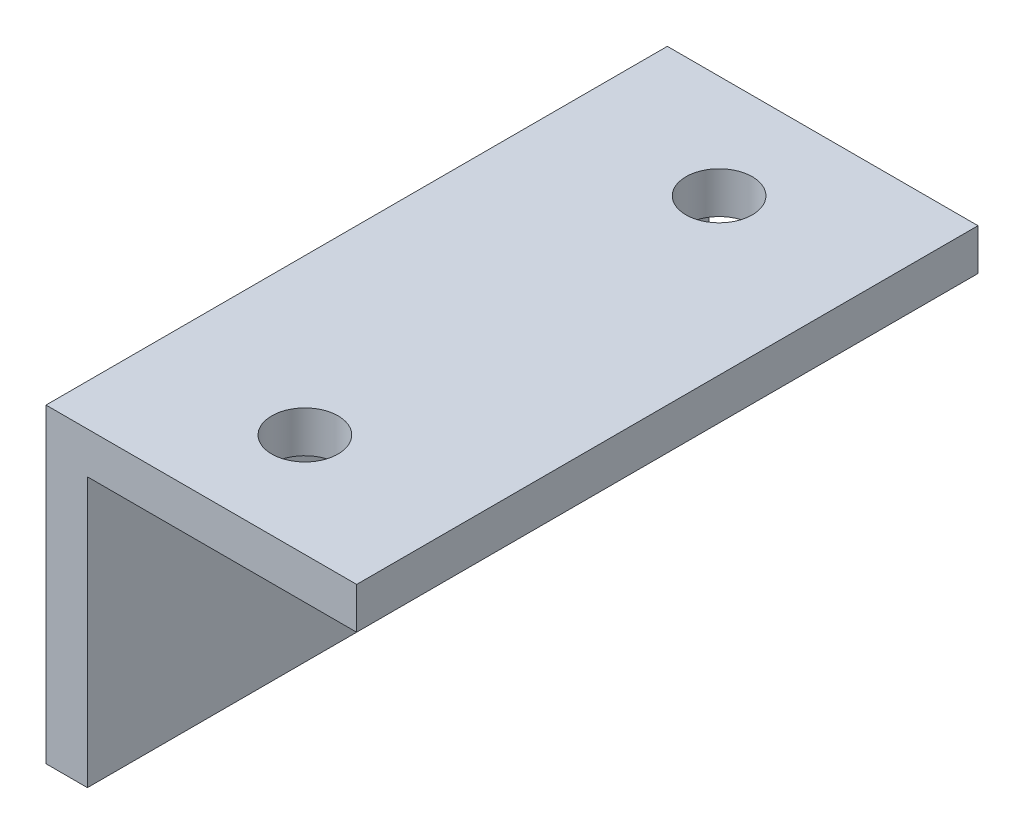
ISO-10303-21;
HEADER;
FILE_DESCRIPTION(('STEP AP214'),'2;1');
FILE_NAME('part.step','',(''),(''),'','','');
FILE_SCHEMA(('AUTOMOTIVE_DESIGN { 1 0 10303 214 1 1 1 1 }'));
ENDSEC;
DATA;
#1=APPLICATION_CONTEXT('core data for automotive mechanical design processes');
#2=APPLICATION_PROTOCOL_DEFINITION('international standard','automotive_design',2000,#1);
#3=PRODUCT_CONTEXT('',#1,'mechanical');
#4=PRODUCT('Part','Part','',(#3));
#5=PRODUCT_RELATED_PRODUCT_CATEGORY('part','',(#4));
#6=PRODUCT_DEFINITION_FORMATION('','',#4);
#7=PRODUCT_DEFINITION_CONTEXT('part definition',#1,'design');
#8=PRODUCT_DEFINITION('design','',#6,#7);
#9=PRODUCT_DEFINITION_SHAPE('','',#8);
#10=(LENGTH_UNIT() NAMED_UNIT(*) SI_UNIT(.MILLI.,.METRE.));
#11=(NAMED_UNIT(*) PLANE_ANGLE_UNIT() SI_UNIT($,.RADIAN.));
#12=(NAMED_UNIT(*) SI_UNIT($,.STERADIAN.) SOLID_ANGLE_UNIT());
#13=UNCERTAINTY_MEASURE_WITH_UNIT(LENGTH_MEASURE(1.E-05),#10,'distance_accuracy_value','');
#14=(GEOMETRIC_REPRESENTATION_CONTEXT(3) GLOBAL_UNCERTAINTY_ASSIGNED_CONTEXT((#13)) GLOBAL_UNIT_ASSIGNED_CONTEXT((#10,
#11,#12)) REPRESENTATION_CONTEXT('',''));
#15=CARTESIAN_POINT('',(0.,0.,0.));
#16=DIRECTION('',(0.,0.,1.));
#17=DIRECTION('',(1.,0.,0.));
#18=AXIS2_PLACEMENT_3D('',#15,#16,#17);
#19=CARTESIAN_POINT('',(15.,0.,30.));
#20=DIRECTION('',(0.,-1.,0.));
#21=DIRECTION('',(1.,0.,0.));
#22=AXIS2_PLACEMENT_3D('',#19,#20,#21);
#23=PLANE('',#22);
#24=CARTESIAN_POINT('',(7.5,0.,5.));
#25=DIRECTION('',(0.,1.,0.));
#26=DIRECTION('',(-1.,0.,0.));
#27=AXIS2_PLACEMENT_3D('',#24,#25,#26);
#28=CIRCLE('',#27,1.6);
#29=CARTESIAN_POINT('',(5.9,0.,5.));
#30=VERTEX_POINT('',#29);
#31=EDGE_CURVE('E138',#30,#30,#28,.T.);
#32=ORIENTED_EDGE('',*,*,#31,.F.);
#33=EDGE_LOOP('',(#32));
#34=FACE_BOUND('',#33,.T.);
#35=CARTESIAN_POINT('',(7.5,0.,25.));
#36=DIRECTION('',(0.,1.,0.));
#37=DIRECTION('',(-1.,0.,0.));
#38=AXIS2_PLACEMENT_3D('',#35,#36,#37);
#39=CIRCLE('',#38,1.6);
#40=CARTESIAN_POINT('',(5.9,0.,25.));
#41=VERTEX_POINT('',#40);
#42=EDGE_CURVE('E173',#41,#41,#39,.T.);
#43=ORIENTED_EDGE('',*,*,#42,.F.);
#44=EDGE_LOOP('',(#43));
#45=FACE_BOUND('',#44,.T.);
#46=DIRECTION('',(-1.,0.,0.));
#47=VECTOR('',#46,1.);
#48=CARTESIAN_POINT('',(15.,0.,0.));
#49=LINE('',#48,#47);
#50=CARTESIAN_POINT('',(15.,0.,0.));
#51=VERTEX_POINT('',#50);
#52=CARTESIAN_POINT('',(0.,0.,0.));
#53=VERTEX_POINT('',#52);
#54=EDGE_CURVE('E119',#51,#53,#49,.T.);
#55=ORIENTED_EDGE('',*,*,#54,.T.);
#56=DIRECTION('',(0.,0.,-1.));
#57=VECTOR('',#56,1.);
#58=CARTESIAN_POINT('',(0.,0.,30.));
#59=LINE('',#58,#57);
#60=CARTESIAN_POINT('',(0.,0.,30.));
#61=VERTEX_POINT('',#60);
#62=EDGE_CURVE('E11',#61,#53,#59,.T.);
#63=ORIENTED_EDGE('',*,*,#62,.F.);
#64=DIRECTION('',(-1.,0.,0.));
#65=VECTOR('',#64,1.);
#66=CARTESIAN_POINT('',(15.,0.,30.));
#67=LINE('',#66,#65);
#68=CARTESIAN_POINT('',(15.,0.,30.));
#69=VERTEX_POINT('',#68);
#70=EDGE_CURVE('E130',#69,#61,#67,.T.);
#71=ORIENTED_EDGE('',*,*,#70,.F.);
#72=DIRECTION('',(0.,0.,-1.));
#73=VECTOR('',#72,1.);
#74=CARTESIAN_POINT('',(15.,0.,30.));
#75=LINE('',#74,#73);
#76=EDGE_CURVE('E115',#69,#51,#75,.T.);
#77=ORIENTED_EDGE('',*,*,#76,.T.);
#78=EDGE_LOOP('',(#55,#63,#71,#77));
#79=FACE_BOUND('',#78,.T.);
#80=ADVANCED_FACE('F33',(#34,#45,#79),#23,.F.);
#81=CARTESIAN_POINT('',(0.,0.,30.));
#82=DIRECTION('',(1.,0.,0.));
#83=DIRECTION('',(0.,1.,0.));
#84=AXIS2_PLACEMENT_3D('',#81,#82,#83);
#85=PLANE('',#84);
#86=CARTESIAN_POINT('',(0.,-9.,15.));
#87=DIRECTION('',(-1.,0.,0.));
#88=DIRECTION('',(0.,-1.,0.));
#89=AXIS2_PLACEMENT_3D('',#86,#87,#88);
#90=CIRCLE('',#89,2.1);
#91=CARTESIAN_POINT('',(0.,-11.1,15.));
#92=VERTEX_POINT('',#91);
#93=EDGE_CURVE('E185',#92,#92,#90,.T.);
#94=ORIENTED_EDGE('',*,*,#93,.F.);
#95=EDGE_LOOP('',(#94));
#96=FACE_BOUND('',#95,.T.);
#97=DIRECTION('',(0.,-1.,0.));
#98=VECTOR('',#97,1.);
#99=CARTESIAN_POINT('',(0.,0.,0.));
#100=LINE('',#99,#98);
#101=CARTESIAN_POINT('',(0.,-15.,0.));
#102=VERTEX_POINT('',#101);
#103=EDGE_CURVE('E122',#53,#102,#100,.T.);
#104=ORIENTED_EDGE('',*,*,#103,.T.);
#105=DIRECTION('',(0.,0.,-1.));
#106=VECTOR('',#105,1.);
#107=CARTESIAN_POINT('',(0.,-15.,30.));
#108=LINE('',#107,#106);
#109=CARTESIAN_POINT('',(0.,-15.,30.));
#110=VERTEX_POINT('',#109);
#111=EDGE_CURVE('E42',#110,#102,#108,.T.);
#112=ORIENTED_EDGE('',*,*,#111,.F.);
#113=DIRECTION('',(0.,-1.,0.));
#114=VECTOR('',#113,1.);
#115=CARTESIAN_POINT('',(0.,0.,30.));
#116=LINE('',#115,#114);
#117=EDGE_CURVE('E88',#61,#110,#116,.T.);
#118=ORIENTED_EDGE('',*,*,#117,.F.);
#119=ORIENTED_EDGE('',*,*,#62,.T.);
#120=EDGE_LOOP('',(#104,#112,#118,#119));
#121=FACE_BOUND('',#120,.T.);
#122=ADVANCED_FACE('F161',(#96,#121),#85,.F.);
#123=CARTESIAN_POINT('',(0.,-15.,30.));
#124=DIRECTION('',(0.,1.,0.));
#125=DIRECTION('',(0.,0.,1.));
#126=AXIS2_PLACEMENT_3D('',#123,#124,#125);
#127=PLANE('',#126);
#128=DIRECTION('',(1.,0.,0.));
#129=VECTOR('',#128,1.);
#130=CARTESIAN_POINT('',(0.,-15.,0.));
#131=LINE('',#130,#129);
#132=CARTESIAN_POINT('',(2.,-15.,0.));
#133=VERTEX_POINT('',#132);
#134=EDGE_CURVE('E125',#102,#133,#131,.T.);
#135=ORIENTED_EDGE('',*,*,#134,.T.);
#136=DIRECTION('',(0.,0.,-1.));
#137=VECTOR('',#136,1.);
#138=CARTESIAN_POINT('',(2.,-15.,30.));
#139=LINE('',#138,#137);
#140=CARTESIAN_POINT('',(2.,-15.,30.));
#141=VERTEX_POINT('',#140);
#142=EDGE_CURVE('E110',#141,#133,#139,.T.);
#143=ORIENTED_EDGE('',*,*,#142,.F.);
#144=DIRECTION('',(1.,0.,0.));
#145=VECTOR('',#144,1.);
#146=CARTESIAN_POINT('',(0.,-15.,30.));
#147=LINE('',#146,#145);
#148=EDGE_CURVE('E101',#110,#141,#147,.T.);
#149=ORIENTED_EDGE('',*,*,#148,.F.);
#150=ORIENTED_EDGE('',*,*,#111,.T.);
#151=EDGE_LOOP('',(#135,#143,#149,#150));
#152=FACE_BOUND('',#151,.T.);
#153=ADVANCED_FACE('F166',(#152),#127,.F.);
#154=CARTESIAN_POINT('',(2.,-15.,30.));
#155=DIRECTION('',(-1.,0.,0.));
#156=DIRECTION('',(0.,-1.,0.));
#157=AXIS2_PLACEMENT_3D('',#154,#155,#156);
#158=PLANE('',#157);
#159=CARTESIAN_POINT('',(2.,-9.,15.));
#160=DIRECTION('',(-1.,0.,0.));
#161=DIRECTION('',(0.,-1.,0.));
#162=AXIS2_PLACEMENT_3D('',#159,#160,#161);
#163=CIRCLE('',#162,2.1);
#164=CARTESIAN_POINT('',(2.,-11.1,15.));
#165=VERTEX_POINT('',#164);
#166=EDGE_CURVE('E36',#165,#165,#163,.T.);
#167=ORIENTED_EDGE('',*,*,#166,.T.);
#168=EDGE_LOOP('',(#167));
#169=FACE_BOUND('',#168,.T.);
#170=DIRECTION('',(0.,1.,0.));
#171=VECTOR('',#170,1.);
#172=CARTESIAN_POINT('',(2.,-15.,0.));
#173=LINE('',#172,#171);
#174=CARTESIAN_POINT('',(2.,-2.,0.));
#175=VERTEX_POINT('',#174);
#176=EDGE_CURVE('E109',#133,#175,#173,.T.);
#177=ORIENTED_EDGE('',*,*,#176,.T.);
#178=DIRECTION('',(0.,0.,-1.));
#179=VECTOR('',#178,1.);
#180=CARTESIAN_POINT('',(2.,-2.,30.));
#181=LINE('',#180,#179);
#182=CARTESIAN_POINT('',(2.,-2.,30.));
#183=VERTEX_POINT('',#182);
#184=EDGE_CURVE('E106',#183,#175,#181,.T.);
#185=ORIENTED_EDGE('',*,*,#184,.F.);
#186=DIRECTION('',(0.,1.,0.));
#187=VECTOR('',#186,1.);
#188=CARTESIAN_POINT('',(2.,-15.,30.));
#189=LINE('',#188,#187);
#190=EDGE_CURVE('E95',#141,#183,#189,.T.);
#191=ORIENTED_EDGE('',*,*,#190,.F.);
#192=ORIENTED_EDGE('',*,*,#142,.T.);
#193=EDGE_LOOP('',(#177,#185,#191,#192));
#194=FACE_BOUND('',#193,.T.);
#195=ADVANCED_FACE('F107',(#169,#194),#158,.F.);
#196=CARTESIAN_POINT('',(2.,-2.,30.));
#197=DIRECTION('',(0.,1.,0.));
#198=DIRECTION('',(0.,0.,1.));
#199=AXIS2_PLACEMENT_3D('',#196,#197,#198);
#200=PLANE('',#199);
#201=CARTESIAN_POINT('',(7.5,-2.,5.));
#202=DIRECTION('',(0.,1.,0.));
#203=DIRECTION('',(0.,0.,1.));
#204=AXIS2_PLACEMENT_3D('',#201,#202,#203);
#205=CIRCLE('',#204,1.6);
#206=CARTESIAN_POINT('',(7.5,-2.,6.6));
#207=VERTEX_POINT('',#206);
#208=EDGE_CURVE('E123',#207,#207,#205,.T.);
#209=ORIENTED_EDGE('',*,*,#208,.T.);
#210=EDGE_LOOP('',(#209));
#211=FACE_BOUND('',#210,.T.);
#212=CARTESIAN_POINT('',(7.5,-2.,25.));
#213=DIRECTION('',(0.,1.,0.));
#214=DIRECTION('',(0.,0.,1.));
#215=AXIS2_PLACEMENT_3D('',#212,#213,#214);
#216=CIRCLE('',#215,1.6);
#217=CARTESIAN_POINT('',(7.5,-2.,26.6));
#218=VERTEX_POINT('',#217);
#219=EDGE_CURVE('E136',#218,#218,#216,.T.);
#220=ORIENTED_EDGE('',*,*,#219,.T.);
#221=EDGE_LOOP('',(#220));
#222=FACE_BOUND('',#221,.T.);
#223=DIRECTION('',(1.,0.,0.));
#224=VECTOR('',#223,1.);
#225=CARTESIAN_POINT('',(2.,-2.,0.));
#226=LINE('',#225,#224);
#227=CARTESIAN_POINT('',(15.,-2.,0.));
#228=VERTEX_POINT('',#227);
#229=EDGE_CURVE('E74',#175,#228,#226,.T.);
#230=ORIENTED_EDGE('',*,*,#229,.T.);
#231=DIRECTION('',(0.,0.,-1.));
#232=VECTOR('',#231,1.);
#233=CARTESIAN_POINT('',(15.,-2.,30.));
#234=LINE('',#233,#232);
#235=CARTESIAN_POINT('',(15.,-2.,30.));
#236=VERTEX_POINT('',#235);
#237=EDGE_CURVE('E111',#236,#228,#234,.T.);
#238=ORIENTED_EDGE('',*,*,#237,.F.);
#239=DIRECTION('',(1.,0.,0.));
#240=VECTOR('',#239,1.);
#241=CARTESIAN_POINT('',(2.,-2.,30.));
#242=LINE('',#241,#240);
#243=EDGE_CURVE('E99',#183,#236,#242,.T.);
#244=ORIENTED_EDGE('',*,*,#243,.F.);
#245=ORIENTED_EDGE('',*,*,#184,.T.);
#246=EDGE_LOOP('',(#230,#238,#244,#245));
#247=FACE_BOUND('',#246,.T.);
#248=ADVANCED_FACE('F113',(#211,#222,#247),#200,.F.);
#249=CARTESIAN_POINT('',(15.,-2.,30.));
#250=DIRECTION('',(-1.,0.,0.));
#251=DIRECTION('',(0.,-1.,0.));
#252=AXIS2_PLACEMENT_3D('',#249,#250,#251);
#253=PLANE('',#252);
#254=DIRECTION('',(0.,1.,0.));
#255=VECTOR('',#254,1.);
#256=CARTESIAN_POINT('',(15.,-2.,0.));
#257=LINE('',#256,#255);
#258=EDGE_CURVE('E80',#228,#51,#257,.T.);
#259=ORIENTED_EDGE('',*,*,#258,.T.);
#260=ORIENTED_EDGE('',*,*,#76,.F.);
#261=DIRECTION('',(0.,1.,0.));
#262=VECTOR('',#261,1.);
#263=CARTESIAN_POINT('',(15.,-2.,30.));
#264=LINE('',#263,#262);
#265=EDGE_CURVE('E51',#236,#69,#264,.T.);
#266=ORIENTED_EDGE('',*,*,#265,.F.);
#267=ORIENTED_EDGE('',*,*,#237,.T.);
#268=EDGE_LOOP('',(#259,#260,#266,#267));
#269=FACE_BOUND('',#268,.T.);
#270=ADVANCED_FACE('F198',(#269),#253,.F.);
#271=CARTESIAN_POINT('',(0.,0.,30.));
#272=DIRECTION('',(0.,0.,1.));
#273=DIRECTION('',(1.,0.,0.));
#274=AXIS2_PLACEMENT_3D('',#271,#272,#273);
#275=PLANE('',#274);
#276=ORIENTED_EDGE('',*,*,#70,.T.);
#277=ORIENTED_EDGE('',*,*,#117,.T.);
#278=ORIENTED_EDGE('',*,*,#148,.T.);
#279=ORIENTED_EDGE('',*,*,#190,.T.);
#280=ORIENTED_EDGE('',*,*,#243,.T.);
#281=ORIENTED_EDGE('',*,*,#265,.T.);
#282=EDGE_LOOP('',(#276,#277,#278,#279,#280,#281));
#283=FACE_BOUND('',#282,.T.);
#284=ADVANCED_FACE('F97',(#283),#275,.T.);
#285=CARTESIAN_POINT('',(0.,0.,0.));
#286=DIRECTION('',(0.,0.,1.));
#287=DIRECTION('',(1.,0.,0.));
#288=AXIS2_PLACEMENT_3D('',#285,#286,#287);
#289=PLANE('',#288);
#290=ORIENTED_EDGE('',*,*,#54,.F.);
#291=ORIENTED_EDGE('',*,*,#258,.F.);
#292=ORIENTED_EDGE('',*,*,#229,.F.);
#293=ORIENTED_EDGE('',*,*,#176,.F.);
#294=ORIENTED_EDGE('',*,*,#134,.F.);
#295=ORIENTED_EDGE('',*,*,#103,.F.);
#296=EDGE_LOOP('',(#290,#291,#292,#293,#294,#295));
#297=FACE_BOUND('',#296,.T.);
#298=ADVANCED_FACE('F156',(#297),#289,.F.);
#299=CARTESIAN_POINT('',(7.5,-30.,25.));
#300=DIRECTION('',(0.,1.,0.));
#301=DIRECTION('',(-1.,0.,0.));
#302=AXIS2_PLACEMENT_3D('',#299,#300,#301);
#303=CYLINDRICAL_SURFACE('',#302,1.6);
#304=ORIENTED_EDGE('',*,*,#42,.T.);
#305=EDGE_LOOP('',(#304));
#306=FACE_BOUND('',#305,.T.);
#307=ORIENTED_EDGE('',*,*,#219,.F.);
#308=EDGE_LOOP('',(#307));
#309=FACE_BOUND('',#308,.T.);
#310=ADVANCED_FACE('F147',(#306,#309),#303,.F.);
#311=CARTESIAN_POINT('',(7.5,-30.,5.));
#312=DIRECTION('',(0.,1.,0.));
#313=DIRECTION('',(-1.,0.,0.));
#314=AXIS2_PLACEMENT_3D('',#311,#312,#313);
#315=CYLINDRICAL_SURFACE('',#314,1.6);
#316=ORIENTED_EDGE('',*,*,#31,.T.);
#317=EDGE_LOOP('',(#316));
#318=FACE_BOUND('',#317,.T.);
#319=ORIENTED_EDGE('',*,*,#208,.F.);
#320=EDGE_LOOP('',(#319));
#321=FACE_BOUND('',#320,.T.);
#322=ADVANCED_FACE('F144',(#318,#321),#315,.F.);
#323=CARTESIAN_POINT('',(30.,-9.,15.));
#324=DIRECTION('',(-1.,0.,0.));
#325=DIRECTION('',(0.,-1.,0.));
#326=AXIS2_PLACEMENT_3D('',#323,#324,#325);
#327=CYLINDRICAL_SURFACE('',#326,2.1);
#328=ORIENTED_EDGE('',*,*,#93,.T.);
#329=EDGE_LOOP('',(#328));
#330=FACE_BOUND('',#329,.T.);
#331=ORIENTED_EDGE('',*,*,#166,.F.);
#332=EDGE_LOOP('',(#331));
#333=FACE_BOUND('',#332,.T.);
#334=ADVANCED_FACE('F146',(#330,#333),#327,.F.);
#335=CLOSED_SHELL('',(#80,#122,#153,#195,#248,#270,#284,#298,#310,#322,#334));
#336=MANIFOLD_SOLID_BREP('B2',#335);
#337=ADVANCED_BREP_SHAPE_REPRESENTATION('',(#18,#336),#14);
#338=SHAPE_DEFINITION_REPRESENTATION(#9,#337);
ENDSEC;
END-ISO-10303-21;
